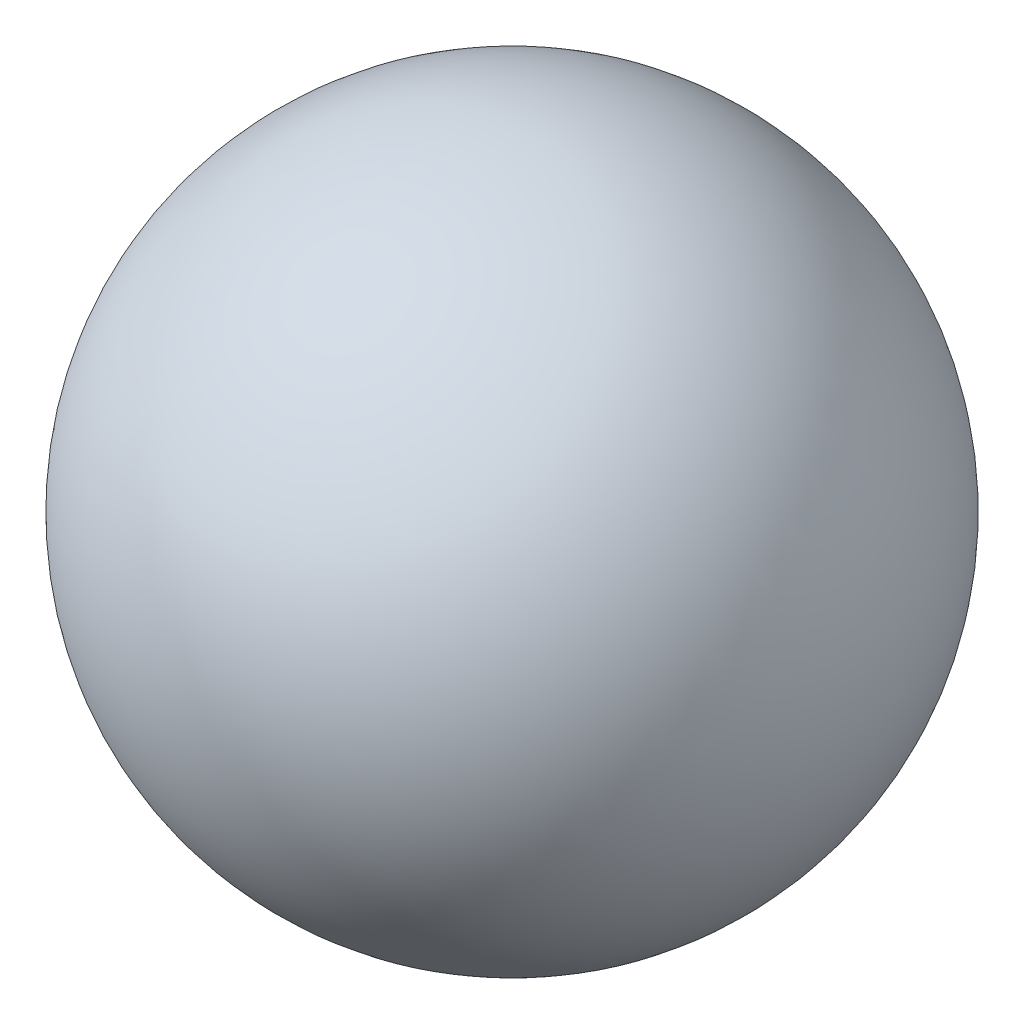
ISO-10303-21;
HEADER;
FILE_DESCRIPTION(('STEP AP214'),'2;1');
FILE_NAME('part.step','',(''),(''),'','','');
FILE_SCHEMA(('AUTOMOTIVE_DESIGN { 1 0 10303 214 1 1 1 1 }'));
ENDSEC;
DATA;
#1=APPLICATION_CONTEXT('core data for automotive mechanical design processes');
#2=APPLICATION_PROTOCOL_DEFINITION('international standard','automotive_design',2000,#1);
#3=PRODUCT_CONTEXT('',#1,'mechanical');
#4=PRODUCT('Part','Part','',(#3));
#5=PRODUCT_RELATED_PRODUCT_CATEGORY('part','',(#4));
#6=PRODUCT_DEFINITION_FORMATION('','',#4);
#7=PRODUCT_DEFINITION_CONTEXT('part definition',#1,'design');
#8=PRODUCT_DEFINITION('design','',#6,#7);
#9=PRODUCT_DEFINITION_SHAPE('','',#8);
#10=(LENGTH_UNIT() NAMED_UNIT(*) SI_UNIT(.MILLI.,.METRE.));
#11=(NAMED_UNIT(*) PLANE_ANGLE_UNIT() SI_UNIT($,.RADIAN.));
#12=(NAMED_UNIT(*) SI_UNIT($,.STERADIAN.) SOLID_ANGLE_UNIT());
#13=UNCERTAINTY_MEASURE_WITH_UNIT(LENGTH_MEASURE(1.E-05),#10,'distance_accuracy_value','');
#14=(GEOMETRIC_REPRESENTATION_CONTEXT(3) GLOBAL_UNCERTAINTY_ASSIGNED_CONTEXT((#13)) GLOBAL_UNIT_ASSIGNED_CONTEXT((#10,
#11,#12)) REPRESENTATION_CONTEXT('',''));
#15=CARTESIAN_POINT('',(0.,0.,0.));
#16=DIRECTION('',(0.,0.,1.));
#17=DIRECTION('',(1.,0.,0.));
#18=AXIS2_PLACEMENT_3D('',#15,#16,#17);
#19=CARTESIAN_POINT('',(0.,0.,0.));
#20=DIRECTION('',(0.,1.,0.));
#21=DIRECTION('',(-1.,0.,0.));
#22=AXIS2_PLACEMENT_3D('',#19,#20,#21);
#23=SPHERICAL_SURFACE('',#22,120.);
#24=CARTESIAN_POINT('',(0.,120.,0.));
#25=VERTEX_POINT('',#24);
#26=VERTEX_LOOP('',#25);
#27=FACE_BOUND('',#26,.T.);
#28=ADVANCED_FACE('F31',(#27),#23,.T.);
#29=CLOSED_SHELL('',(#28));
#30=MANIFOLD_SOLID_BREP('B2',#29);
#31=ADVANCED_BREP_SHAPE_REPRESENTATION('',(#18,#30),#14);
#32=SHAPE_DEFINITION_REPRESENTATION(#9,#31);
ENDSEC;
END-ISO-10303-21;
